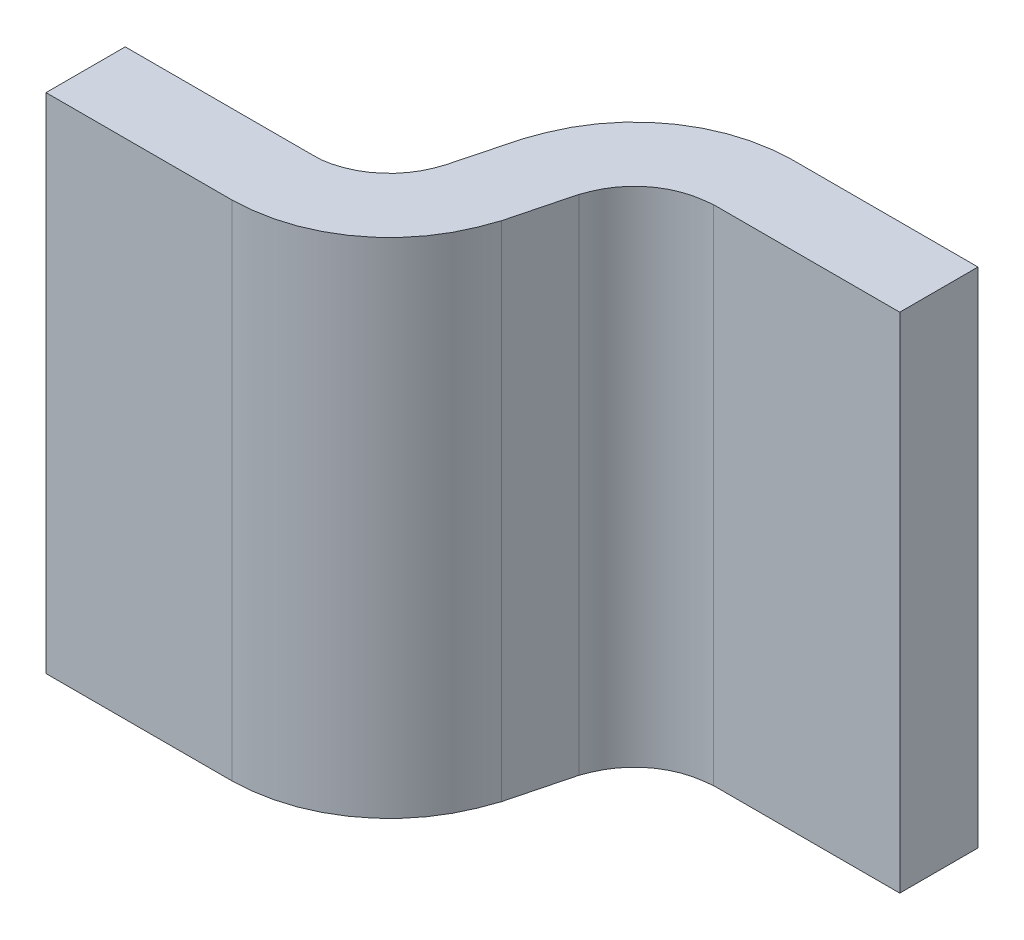
ISO-10303-21;
HEADER;
FILE_DESCRIPTION(('STEP AP214'),'2;1');
FILE_NAME('part.step','',(''),(''),'','','');
FILE_SCHEMA(('AUTOMOTIVE_DESIGN { 1 0 10303 214 1 1 1 1 }'));
ENDSEC;
DATA;
#1=APPLICATION_CONTEXT('core data for automotive mechanical design processes');
#2=APPLICATION_PROTOCOL_DEFINITION('international standard','automotive_design',2000,#1);
#3=PRODUCT_CONTEXT('',#1,'mechanical');
#4=PRODUCT('Part','Part','',(#3));
#5=PRODUCT_RELATED_PRODUCT_CATEGORY('part','',(#4));
#6=PRODUCT_DEFINITION_FORMATION('','',#4);
#7=PRODUCT_DEFINITION_CONTEXT('part definition',#1,'design');
#8=PRODUCT_DEFINITION('design','',#6,#7);
#9=PRODUCT_DEFINITION_SHAPE('','',#8);
#10=(LENGTH_UNIT() NAMED_UNIT(*) SI_UNIT(.MILLI.,.METRE.));
#11=(NAMED_UNIT(*) PLANE_ANGLE_UNIT() SI_UNIT($,.RADIAN.));
#12=(NAMED_UNIT(*) SI_UNIT($,.STERADIAN.) SOLID_ANGLE_UNIT());
#13=UNCERTAINTY_MEASURE_WITH_UNIT(LENGTH_MEASURE(1.E-05),#10,'distance_accuracy_value','');
#14=(GEOMETRIC_REPRESENTATION_CONTEXT(3) GLOBAL_UNCERTAINTY_ASSIGNED_CONTEXT((#13)) GLOBAL_UNIT_ASSIGNED_CONTEXT((#10,
#11,#12)) REPRESENTATION_CONTEXT('',''));
#15=CARTESIAN_POINT('',(0.,0.,0.));
#16=DIRECTION('',(0.,0.,1.));
#17=DIRECTION('',(1.,0.,0.));
#18=AXIS2_PLACEMENT_3D('',#15,#16,#17);
#19=CARTESIAN_POINT('',(0.876,-0.696,0.238));
#20=DIRECTION('',(-1.,0.,0.));
#21=DIRECTION('',(0.,0.,1.));
#22=AXIS2_PLACEMENT_3D('',#19,#20,#21);
#23=PLANE('',#22);
#24=DIRECTION('',(0.,1.,0.));
#25=VECTOR('',#24,1.);
#26=CARTESIAN_POINT('',(0.876,-1.204,0.238));
#27=LINE('',#26,#25);
#28=CARTESIAN_POINT('',(0.876,-1.204,0.238));
#29=VERTEX_POINT('',#28);
#30=CARTESIAN_POINT('',(0.876,-0.696,0.238));
#31=VERTEX_POINT('',#30);
#32=EDGE_CURVE('E11',#29,#31,#27,.T.);
#33=ORIENTED_EDGE('',*,*,#32,.F.);
#34=DIRECTION('',(0.,0.,-1.));
#35=VECTOR('',#34,1.);
#36=CARTESIAN_POINT('',(0.876,-1.204,0.318));
#37=LINE('',#36,#35);
#38=CARTESIAN_POINT('',(0.876,-1.204,0.318));
#39=VERTEX_POINT('',#38);
#40=EDGE_CURVE('E24',#39,#29,#37,.T.);
#41=ORIENTED_EDGE('',*,*,#40,.F.);
#42=DIRECTION('',(0.,-1.,0.));
#43=VECTOR('',#42,1.);
#44=CARTESIAN_POINT('',(0.876,-0.696,0.318));
#45=LINE('',#44,#43);
#46=CARTESIAN_POINT('',(0.876,-0.696,0.318));
#47=VERTEX_POINT('',#46);
#48=EDGE_CURVE('E439',#47,#39,#45,.T.);
#49=ORIENTED_EDGE('',*,*,#48,.F.);
#50=DIRECTION('',(0.,0.,1.));
#51=VECTOR('',#50,1.);
#52=CARTESIAN_POINT('',(0.876,-0.696,0.238));
#53=LINE('',#52,#51);
#54=EDGE_CURVE('E437',#31,#47,#53,.T.);
#55=ORIENTED_EDGE('',*,*,#54,.F.);
#56=EDGE_LOOP('',(#33,#41,#49,#55));
#57=FACE_BOUND('',#56,.T.);
#58=ADVANCED_FACE('F17',(#57),#23,.T.);
#59=CARTESIAN_POINT('',(0.876,-0.696,0.318));
#60=DIRECTION('',(0.,0.,1.));
#61=DIRECTION('',(0.,1.,0.));
#62=AXIS2_PLACEMENT_3D('',#59,#60,#61);
#63=PLANE('',#62);
#64=ORIENTED_EDGE('',*,*,#48,.T.);
#65=DIRECTION('',(-1.,0.,0.));
#66=VECTOR('',#65,1.);
#67=CARTESIAN_POINT('',(1.064,-1.204,0.318));
#68=LINE('',#67,#66);
#69=CARTESIAN_POINT('',(1.064,-1.204,0.318));
#70=VERTEX_POINT('',#69);
#71=EDGE_CURVE('E435',#70,#39,#68,.T.);
#72=ORIENTED_EDGE('',*,*,#71,.F.);
#73=CARTESIAN_POINT('',(1.064,-0.696,0.31775));
#74=DIRECTION('',(0.,-1.,0.));
#75=VECTOR('',#74,1.);
#76=LINE('',#73,#75);
#77=CARTESIAN_POINT('',(1.064,-0.696,0.318));
#78=VERTEX_POINT('',#77);
#79=EDGE_CURVE('E257',#78,#70,#76,.T.);
#80=ORIENTED_EDGE('',*,*,#79,.F.);
#81=DIRECTION('',(1.,0.,0.));
#82=VECTOR('',#81,1.);
#83=CARTESIAN_POINT('',(0.876,-0.696,0.318));
#84=LINE('',#83,#82);
#85=EDGE_CURVE('E247',#47,#78,#84,.T.);
#86=ORIENTED_EDGE('',*,*,#85,.F.);
#87=EDGE_LOOP('',(#64,#72,#80,#86));
#88=FACE_BOUND('',#87,.T.);
#89=ADVANCED_FACE('F237',(#88),#63,.T.);
#90=CARTESIAN_POINT('',(0.876,-1.204,0.238));
#91=DIRECTION('',(0.,0.,-1.));
#92=DIRECTION('',(0.,1.,0.));
#93=AXIS2_PLACEMENT_3D('',#90,#91,#92);
#94=PLANE('',#93);
#95=ORIENTED_EDGE('',*,*,#32,.T.);
#96=DIRECTION('',(-1.,0.,0.));
#97=VECTOR('',#96,1.);
#98=CARTESIAN_POINT('',(1.064,-0.696,0.238));
#99=LINE('',#98,#97);
#100=CARTESIAN_POINT('',(1.064,-0.696,0.238));
#101=VERTEX_POINT('',#100);
#102=EDGE_CURVE('E443',#101,#31,#99,.T.);
#103=ORIENTED_EDGE('',*,*,#102,.F.);
#104=CARTESIAN_POINT('',(1.064,-1.204,0.238375));
#105=DIRECTION('',(0.,1.,0.));
#106=VECTOR('',#105,1.);
#107=LINE('',#104,#106);
#108=CARTESIAN_POINT('',(1.064,-1.204,0.238));
#109=VERTEX_POINT('',#108);
#110=EDGE_CURVE('E222',#109,#101,#107,.T.);
#111=ORIENTED_EDGE('',*,*,#110,.F.);
#112=DIRECTION('',(1.,0.,0.));
#113=VECTOR('',#112,1.);
#114=CARTESIAN_POINT('',(0.876,-1.204,0.238));
#115=LINE('',#114,#113);
#116=EDGE_CURVE('E219',#29,#109,#115,.T.);
#117=ORIENTED_EDGE('',*,*,#116,.F.);
#118=EDGE_LOOP('',(#95,#103,#111,#117));
#119=FACE_BOUND('',#118,.T.);
#120=ADVANCED_FACE('F228',(#119),#94,.T.);
#121=CARTESIAN_POINT('',(1.234,-1.204,0.138));
#122=DIRECTION('',(0.965885549343203,0.,0.258969313954337));
#123=DIRECTION('',(-0.258969313954337,0.,0.965885549343203));
#124=AXIS2_PLACEMENT_3D('',#121,#122,#123);
#125=PLANE('',#124);
#126=CARTESIAN_POINT('',(1.23442187168926,-0.696,0.138115055915251));
#127=DIRECTION('',(0.,-1.,0.));
#128=VECTOR('',#127,1.);
#129=LINE('',#126,#128);
#130=CARTESIAN_POINT('',(1.234,-0.696,0.138));
#131=VERTEX_POINT('',#130);
#132=CARTESIAN_POINT('',(1.234,-1.204,0.138));
#133=VERTEX_POINT('',#132);
#134=EDGE_CURVE('E215',#131,#133,#129,.T.);
#135=ORIENTED_EDGE('',*,*,#134,.F.);
#136=CARTESIAN_POINT('',(1.218,-0.696,0.2));
#137=DIRECTION('',(0.258969313954338,0.,-0.965885549343202));
#138=VECTOR('',#137,1.);
#139=LINE('',#136,#138);
#140=CARTESIAN_POINT('',(1.218,-0.696,0.2));
#141=VERTEX_POINT('',#140);
#142=EDGE_CURVE('E301',#141,#131,#139,.T.);
#143=ORIENTED_EDGE('',*,*,#142,.F.);
#144=CARTESIAN_POINT('',(1.21740631765688,-1.204,0.199841941713844));
#145=DIRECTION('',(0.,1.,0.));
#146=VECTOR('',#145,1.);
#147=LINE('',#144,#146);
#148=CARTESIAN_POINT('',(1.218,-1.204,0.2));
#149=VERTEX_POINT('',#148);
#150=EDGE_CURVE('E288',#149,#141,#147,.T.);
#151=ORIENTED_EDGE('',*,*,#150,.F.);
#152=DIRECTION('',(-0.258969313954337,0.,0.965885549343202));
#153=VECTOR('',#152,1.);
#154=CARTESIAN_POINT('',(1.234,-1.204,0.138));
#155=LINE('',#154,#153);
#156=EDGE_CURVE('E356',#133,#149,#155,.T.);
#157=ORIENTED_EDGE('',*,*,#156,.F.);
#158=EDGE_LOOP('',(#135,#143,#151,#157));
#159=FACE_BOUND('',#158,.T.);
#160=ADVANCED_FACE('F236',(#159),#125,.T.);
#161=CARTESIAN_POINT('',(1.157,-0.696,0.118));
#162=DIRECTION('',(-0.965885549343203,0.,-0.258969313954337));
#163=DIRECTION('',(-0.258969313954337,0.,0.965885549343203));
#164=AXIS2_PLACEMENT_3D('',#161,#162,#163);
#165=PLANE('',#164);
#166=CARTESIAN_POINT('',(1.15759368234312,-1.204,0.118158058286156));
#167=DIRECTION('',(0.,1.,0.));
#168=VECTOR('',#167,1.);
#169=LINE('',#166,#168);
#170=CARTESIAN_POINT('',(1.157,-1.204,0.118));
#171=VERTEX_POINT('',#170);
#172=CARTESIAN_POINT('',(1.157,-0.696,0.118));
#173=VERTEX_POINT('',#172);
#174=EDGE_CURVE('E342',#171,#173,#169,.T.);
#175=ORIENTED_EDGE('',*,*,#174,.F.);
#176=CARTESIAN_POINT('',(1.141,-1.204,0.179));
#177=DIRECTION('',(0.258969313954335,0.,-0.965885549343203));
#178=VECTOR('',#177,1.);
#179=LINE('',#176,#178);
#180=CARTESIAN_POINT('',(1.141,-1.204,0.179));
#181=VERTEX_POINT('',#180);
#182=EDGE_CURVE('E330',#181,#171,#179,.T.);
#183=ORIENTED_EDGE('',*,*,#182,.F.);
#184=CARTESIAN_POINT('',(1.14082576891933,-0.696,0.178954745173853));
#185=DIRECTION('',(0.,-1.,0.));
#186=VECTOR('',#185,1.);
#187=LINE('',#184,#186);
#188=CARTESIAN_POINT('',(1.141,-0.696,0.179));
#189=VERTEX_POINT('',#188);
#190=EDGE_CURVE('E366',#189,#181,#187,.T.);
#191=ORIENTED_EDGE('',*,*,#190,.F.);
#192=DIRECTION('',(-0.258969313954337,0.,0.965885549343203));
#193=VECTOR('',#192,1.);
#194=CARTESIAN_POINT('',(1.157,-0.696,0.118));
#195=LINE('',#194,#193);
#196=EDGE_CURVE('E368',#173,#189,#195,.T.);
#197=ORIENTED_EDGE('',*,*,#196,.F.);
#198=EDGE_LOOP('',(#175,#183,#191,#197));
#199=FACE_BOUND('',#198,.T.);
#200=ADVANCED_FACE('F160',(#199),#165,.T.);
#201=CARTESIAN_POINT('',(1.499,-1.204,0.079));
#202=DIRECTION('',(0.,0.,1.));
#203=DIRECTION('',(0.,1.,0.));
#204=AXIS2_PLACEMENT_3D('',#201,#202,#203);
#205=PLANE('',#204);
#206=DIRECTION('',(0.,-1.,0.));
#207=VECTOR('',#206,1.);
#208=CARTESIAN_POINT('',(1.499,-0.696,0.079));
#209=LINE('',#208,#207);
#210=CARTESIAN_POINT('',(1.499,-0.696,0.079));
#211=VERTEX_POINT('',#210);
#212=CARTESIAN_POINT('',(1.499,-1.204,0.079));
#213=VERTEX_POINT('',#212);
#214=EDGE_CURVE('E125',#211,#213,#209,.T.);
#215=ORIENTED_EDGE('',*,*,#214,.F.);
#216=DIRECTION('',(1.,0.,0.));
#217=VECTOR('',#216,1.);
#218=CARTESIAN_POINT('',(1.311,-0.696,0.079));
#219=LINE('',#218,#217);
#220=CARTESIAN_POINT('',(1.311,-0.696,0.079));
#221=VERTEX_POINT('',#220);
#222=EDGE_CURVE('E377',#221,#211,#219,.T.);
#223=ORIENTED_EDGE('',*,*,#222,.F.);
#224=CARTESIAN_POINT('',(1.311,-1.204,0.079625));
#225=DIRECTION('',(0.,1.,0.));
#226=VECTOR('',#225,1.);
#227=LINE('',#224,#226);
#228=CARTESIAN_POINT('',(1.311,-1.204,0.079));
#229=VERTEX_POINT('',#228);
#230=EDGE_CURVE('E178',#229,#221,#227,.T.);
#231=ORIENTED_EDGE('',*,*,#230,.F.);
#232=DIRECTION('',(-1.,0.,0.));
#233=VECTOR('',#232,1.);
#234=CARTESIAN_POINT('',(1.499,-1.204,0.079));
#235=LINE('',#234,#233);
#236=EDGE_CURVE('E169',#213,#229,#235,.T.);
#237=ORIENTED_EDGE('',*,*,#236,.F.);
#238=EDGE_LOOP('',(#215,#223,#231,#237));
#239=FACE_BOUND('',#238,.T.);
#240=ADVANCED_FACE('F155',(#239),#205,.T.);
#241=CARTESIAN_POINT('',(1.311,-1.204,0.));
#242=DIRECTION('',(0.,0.,-1.));
#243=DIRECTION('',(0.,1.,0.));
#244=AXIS2_PLACEMENT_3D('',#241,#242,#243);
#245=PLANE('',#244);
#246=CARTESIAN_POINT('',(1.311,-0.696,0.000249999999999979));
#247=DIRECTION('',(0.,-1.,0.));
#248=VECTOR('',#247,1.);
#249=LINE('',#246,#248);
#250=CARTESIAN_POINT('',(1.311,-0.696,0.));
#251=VERTEX_POINT('',#250);
#252=CARTESIAN_POINT('',(1.311,-1.204,0.));
#253=VERTEX_POINT('',#252);
#254=EDGE_CURVE('E140',#251,#253,#249,.T.);
#255=ORIENTED_EDGE('',*,*,#254,.F.);
#256=DIRECTION('',(-1.,0.,0.));
#257=VECTOR('',#256,1.);
#258=CARTESIAN_POINT('',(1.499,-0.696,0.));
#259=LINE('',#258,#257);
#260=CARTESIAN_POINT('',(1.499,-0.696,0.));
#261=VERTEX_POINT('',#260);
#262=EDGE_CURVE('E107',#261,#251,#259,.T.);
#263=ORIENTED_EDGE('',*,*,#262,.F.);
#264=DIRECTION('',(0.,1.,0.));
#265=VECTOR('',#264,1.);
#266=CARTESIAN_POINT('',(1.499,-1.204,0.));
#267=LINE('',#266,#265);
#268=CARTESIAN_POINT('',(1.499,-1.204,0.));
#269=VERTEX_POINT('',#268);
#270=EDGE_CURVE('E101',#269,#261,#267,.T.);
#271=ORIENTED_EDGE('',*,*,#270,.F.);
#272=DIRECTION('',(1.,0.,0.));
#273=VECTOR('',#272,1.);
#274=CARTESIAN_POINT('',(1.311,-1.204,0.));
#275=LINE('',#274,#273);
#276=EDGE_CURVE('E104',#253,#269,#275,.T.);
#277=ORIENTED_EDGE('',*,*,#276,.F.);
#278=EDGE_LOOP('',(#255,#263,#271,#277));
#279=FACE_BOUND('',#278,.T.);
#280=ADVANCED_FACE('F103',(#279),#245,.T.);
#281=CARTESIAN_POINT('',(1.499,-1.204,0.));
#282=DIRECTION('',(1.,0.,0.));
#283=DIRECTION('',(0.,0.,1.));
#284=AXIS2_PLACEMENT_3D('',#281,#282,#283);
#285=PLANE('',#284);
#286=ORIENTED_EDGE('',*,*,#270,.T.);
#287=DIRECTION('',(0.,0.,-1.));
#288=VECTOR('',#287,1.);
#289=CARTESIAN_POINT('',(1.499,-0.696,0.079));
#290=LINE('',#289,#288);
#291=EDGE_CURVE('E122',#211,#261,#290,.T.);
#292=ORIENTED_EDGE('',*,*,#291,.F.);
#293=ORIENTED_EDGE('',*,*,#214,.T.);
#294=DIRECTION('',(0.,0.,1.));
#295=VECTOR('',#294,1.);
#296=CARTESIAN_POINT('',(1.499,-1.204,0.));
#297=LINE('',#296,#295);
#298=EDGE_CURVE('E118',#269,#213,#297,.T.);
#299=ORIENTED_EDGE('',*,*,#298,.F.);
#300=EDGE_LOOP('',(#286,#292,#293,#299));
#301=FACE_BOUND('',#300,.T.);
#302=ADVANCED_FACE('F124',(#301),#285,.T.);
#303=CARTESIAN_POINT('',(1.064,-0.696,0.159));
#304=DIRECTION('',(0.,1.,0.));
#305=DIRECTION('',(0.,0.,1.));
#306=AXIS2_PLACEMENT_3D('',#303,#304,#305);
#307=CYLINDRICAL_SURFACE('',#306,0.15875);
#308=ORIENTED_EDGE('',*,*,#79,.T.);
#309=CARTESIAN_POINT('',(1.064,-1.204,0.159));
#310=DIRECTION('',(0.,-1.,0.));
#311=DIRECTION('',(-0.793107076683516,0.,0.609082231652284));
#312=AXIS2_PLACEMENT_3D('',#309,#310,#311);
#313=CIRCLE('',#312,0.15875);
#314=EDGE_CURVE('E127',#149,#70,#313,.T.);
#315=ORIENTED_EDGE('',*,*,#314,.F.);
#316=ORIENTED_EDGE('',*,*,#150,.T.);
#317=CARTESIAN_POINT('',(1.064,-0.696,0.159));
#318=DIRECTION('',(0.,1.,0.));
#319=DIRECTION('',(0.793107076683516,0.,-0.609082231652284));
#320=AXIS2_PLACEMENT_3D('',#317,#318,#319);
#321=CIRCLE('',#320,0.15875);
#322=EDGE_CURVE('E131',#78,#141,#321,.T.);
#323=ORIENTED_EDGE('',*,*,#322,.F.);
#324=EDGE_LOOP('',(#308,#315,#316,#323));
#325=FACE_BOUND('',#324,.T.);
#326=ADVANCED_FACE('F263',(#325),#307,.T.);
#327=CARTESIAN_POINT('',(1.064,-1.204,0.159));
#328=DIRECTION('',(0.,1.,0.));
#329=DIRECTION('',(0.,0.,-1.));
#330=AXIS2_PLACEMENT_3D('',#327,#328,#329);
#331=CYLINDRICAL_SURFACE('',#330,0.079375);
#332=ORIENTED_EDGE('',*,*,#110,.T.);
#333=CARTESIAN_POINT('',(1.064,-0.696,0.159));
#334=DIRECTION('',(0.,-1.,0.));
#335=DIRECTION('',(-0.793107076683516,0.,0.609082231652284));
#336=AXIS2_PLACEMENT_3D('',#333,#334,#335);
#337=CIRCLE('',#336,0.079375);
#338=EDGE_CURVE('E427',#189,#101,#337,.T.);
#339=ORIENTED_EDGE('',*,*,#338,.F.);
#340=ORIENTED_EDGE('',*,*,#190,.T.);
#341=CARTESIAN_POINT('',(1.064,-1.204,0.159));
#342=DIRECTION('',(0.,1.,0.));
#343=DIRECTION('',(0.793107076683516,0.,-0.609082231652284));
#344=AXIS2_PLACEMENT_3D('',#341,#342,#343);
#345=CIRCLE('',#344,0.079375);
#346=EDGE_CURVE('E423',#109,#181,#345,.T.);
#347=ORIENTED_EDGE('',*,*,#346,.F.);
#348=EDGE_LOOP('',(#332,#339,#340,#347));
#349=FACE_BOUND('',#348,.T.);
#350=ADVANCED_FACE('F195',(#349),#331,.F.);
#351=CARTESIAN_POINT('',(1.311,-1.204,0.159));
#352=DIRECTION('',(0.,1.,0.));
#353=DIRECTION('',(0.,0.,1.));
#354=AXIS2_PLACEMENT_3D('',#351,#352,#353);
#355=CYLINDRICAL_SURFACE('',#354,0.079375);
#356=ORIENTED_EDGE('',*,*,#230,.T.);
#357=CARTESIAN_POINT('',(1.311,-0.696,0.159));
#358=DIRECTION('',(0.,-1.,0.));
#359=DIRECTION('',(0.793107076683516,0.,-0.609082231652284));
#360=AXIS2_PLACEMENT_3D('',#357,#358,#359);
#361=CIRCLE('',#360,0.079375);
#362=EDGE_CURVE('E418',#131,#221,#361,.T.);
#363=ORIENTED_EDGE('',*,*,#362,.F.);
#364=ORIENTED_EDGE('',*,*,#134,.T.);
#365=CARTESIAN_POINT('',(1.311,-1.204,0.159));
#366=DIRECTION('',(0.,1.,0.));
#367=DIRECTION('',(-0.793107076683516,0.,0.609082231652284));
#368=AXIS2_PLACEMENT_3D('',#365,#366,#367);
#369=CIRCLE('',#368,0.079375);
#370=EDGE_CURVE('E408',#229,#133,#369,.T.);
#371=ORIENTED_EDGE('',*,*,#370,.F.);
#372=EDGE_LOOP('',(#356,#363,#364,#371));
#373=FACE_BOUND('',#372,.T.);
#374=ADVANCED_FACE('F184',(#373),#355,.F.);
#375=CARTESIAN_POINT('',(1.311,-1.204,0.159));
#376=DIRECTION('',(0.,1.,0.));
#377=DIRECTION('',(0.,0.,-1.));
#378=AXIS2_PLACEMENT_3D('',#375,#376,#377);
#379=CYLINDRICAL_SURFACE('',#378,0.15875);
#380=ORIENTED_EDGE('',*,*,#254,.T.);
#381=CARTESIAN_POINT('',(1.311,-1.204,0.159));
#382=DIRECTION('',(0.,-1.,0.));
#383=DIRECTION('',(0.793107076683516,0.,-0.609082231652284));
#384=AXIS2_PLACEMENT_3D('',#381,#382,#383);
#385=CIRCLE('',#384,0.15875);
#386=EDGE_CURVE('E121',#171,#253,#385,.T.);
#387=ORIENTED_EDGE('',*,*,#386,.F.);
#388=ORIENTED_EDGE('',*,*,#174,.T.);
#389=CARTESIAN_POINT('',(1.311,-0.696,0.159));
#390=DIRECTION('',(0.,1.,0.));
#391=DIRECTION('',(-0.793107076683516,0.,0.609082231652284));
#392=AXIS2_PLACEMENT_3D('',#389,#390,#391);
#393=CIRCLE('',#392,0.15875);
#394=EDGE_CURVE('E405',#251,#173,#393,.T.);
#395=ORIENTED_EDGE('',*,*,#394,.F.);
#396=EDGE_LOOP('',(#380,#387,#388,#395));
#397=FACE_BOUND('',#396,.T.);
#398=ADVANCED_FACE('F194',(#397),#379,.T.);
#399=CARTESIAN_POINT('',(0.876,-1.204,0.238));
#400=DIRECTION('',(0.,-1.,0.));
#401=DIRECTION('',(1.,0.,0.));
#402=AXIS2_PLACEMENT_3D('',#399,#400,#401);
#403=PLANE('',#402);
#404=ORIENTED_EDGE('',*,*,#71,.T.);
#405=ORIENTED_EDGE('',*,*,#40,.T.);
#406=ORIENTED_EDGE('',*,*,#116,.T.);
#407=ORIENTED_EDGE('',*,*,#346,.T.);
#408=ORIENTED_EDGE('',*,*,#182,.T.);
#409=ORIENTED_EDGE('',*,*,#386,.T.);
#410=ORIENTED_EDGE('',*,*,#276,.T.);
#411=ORIENTED_EDGE('',*,*,#298,.T.);
#412=ORIENTED_EDGE('',*,*,#236,.T.);
#413=ORIENTED_EDGE('',*,*,#370,.T.);
#414=ORIENTED_EDGE('',*,*,#156,.T.);
#415=ORIENTED_EDGE('',*,*,#314,.T.);
#416=EDGE_LOOP('',(#404,#405,#406,#407,#408,#409,#410,#411,#412,#413,#414,#415));
#417=FACE_BOUND('',#416,.T.);
#418=ADVANCED_FACE('F116',(#417),#403,.T.);
#419=CARTESIAN_POINT('',(1.311,-0.696,0.079));
#420=DIRECTION('',(0.,1.,0.));
#421=DIRECTION('',(1.,0.,0.));
#422=AXIS2_PLACEMENT_3D('',#419,#420,#421);
#423=PLANE('',#422);
#424=ORIENTED_EDGE('',*,*,#102,.T.);
#425=ORIENTED_EDGE('',*,*,#54,.T.);
#426=ORIENTED_EDGE('',*,*,#85,.T.);
#427=ORIENTED_EDGE('',*,*,#322,.T.);
#428=ORIENTED_EDGE('',*,*,#142,.T.);
#429=ORIENTED_EDGE('',*,*,#362,.T.);
#430=ORIENTED_EDGE('',*,*,#222,.T.);
#431=ORIENTED_EDGE('',*,*,#291,.T.);
#432=ORIENTED_EDGE('',*,*,#262,.T.);
#433=ORIENTED_EDGE('',*,*,#394,.T.);
#434=ORIENTED_EDGE('',*,*,#196,.T.);
#435=ORIENTED_EDGE('',*,*,#338,.T.);
#436=EDGE_LOOP('',(#424,#425,#426,#427,#428,#429,#430,#431,#432,#433,#434,#435));
#437=FACE_BOUND('',#436,.T.);
#438=ADVANCED_FACE('F306',(#437),#423,.T.);
#439=CLOSED_SHELL('',(#58,#89,#120,#160,#200,#240,#280,#302,#326,#350,#374,#398,#418,#438));
#440=MANIFOLD_SOLID_BREP('B1',#439);
#441=ADVANCED_BREP_SHAPE_REPRESENTATION('',(#18,#440),#14);
#442=SHAPE_DEFINITION_REPRESENTATION(#9,#441);
ENDSEC;
END-ISO-10303-21;
